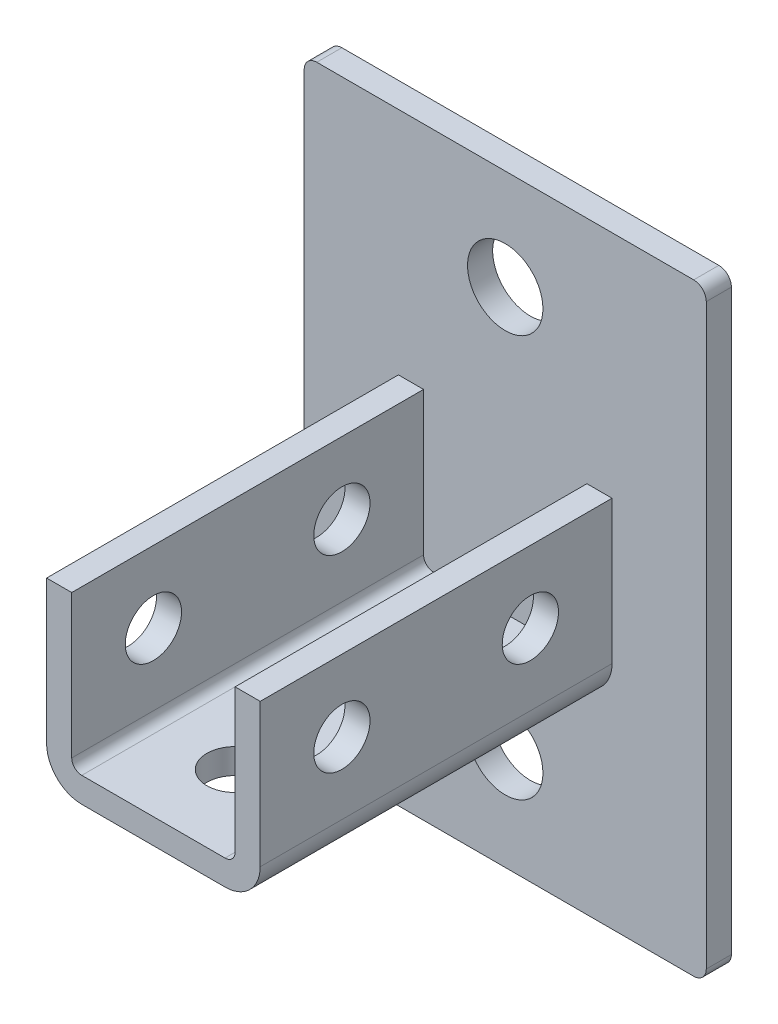
ISO-10303-21;
HEADER;
FILE_DESCRIPTION(('STEP AP214'),'2;1');
FILE_NAME('part.step','',(''),(''),'','','');
FILE_SCHEMA(('AUTOMOTIVE_DESIGN { 1 0 10303 214 1 1 1 1 }'));
ENDSEC;
DATA;
#1=APPLICATION_CONTEXT('core data for automotive mechanical design processes');
#2=APPLICATION_PROTOCOL_DEFINITION('international standard','automotive_design',2000,#1);
#3=PRODUCT_CONTEXT('',#1,'mechanical');
#4=PRODUCT('Part','Part','',(#3));
#5=PRODUCT_RELATED_PRODUCT_CATEGORY('part','',(#4));
#6=PRODUCT_DEFINITION_FORMATION('','',#4);
#7=PRODUCT_DEFINITION_CONTEXT('part definition',#1,'design');
#8=PRODUCT_DEFINITION('design','',#6,#7);
#9=PRODUCT_DEFINITION_SHAPE('','',#8);
#10=(LENGTH_UNIT() NAMED_UNIT(*) SI_UNIT(.MILLI.,.METRE.));
#11=(NAMED_UNIT(*) PLANE_ANGLE_UNIT() SI_UNIT($,.RADIAN.));
#12=(NAMED_UNIT(*) SI_UNIT($,.STERADIAN.) SOLID_ANGLE_UNIT());
#13=UNCERTAINTY_MEASURE_WITH_UNIT(LENGTH_MEASURE(1.E-05),#10,'distance_accuracy_value','');
#14=(GEOMETRIC_REPRESENTATION_CONTEXT(3) GLOBAL_UNCERTAINTY_ASSIGNED_CONTEXT((#13)) GLOBAL_UNIT_ASSIGNED_CONTEXT((#10,
#11,#12)) REPRESENTATION_CONTEXT('',''));
#15=CARTESIAN_POINT('',(0.,0.,0.));
#16=DIRECTION('',(0.,0.,1.));
#17=DIRECTION('',(1.,0.,0.));
#18=AXIS2_PLACEMENT_3D('',#15,#16,#17);
#19=CARTESIAN_POINT('',(-20.6375,18.0975,95.25));
#20=DIRECTION('',(-1.,0.,0.));
#21=DIRECTION('',(0.,-1.,0.));
#22=AXIS2_PLACEMENT_3D('',#19,#20,#21);
#23=PLANE('',#22);
#24=DIRECTION('',(0.,1.,0.));
#25=VECTOR('',#24,1.);
#26=CARTESIAN_POINT('',(-20.6375,18.0975,6.35));
#27=LINE('',#26,#25);
#28=CARTESIAN_POINT('',(-20.6375,-18.0975,6.35));
#29=VERTEX_POINT('',#28);
#30=CARTESIAN_POINT('',(-20.6375,18.0975,6.35));
#31=VERTEX_POINT('',#30);
#32=EDGE_CURVE('E207',#29,#31,#27,.T.);
#33=ORIENTED_EDGE('',*,*,#32,.T.);
#34=DIRECTION('',(0.,0.,-1.));
#35=VECTOR('',#34,1.);
#36=CARTESIAN_POINT('',(-20.6375,18.0975,95.25));
#37=LINE('',#36,#35);
#38=CARTESIAN_POINT('',(-20.6375,18.0975,95.25));
#39=VERTEX_POINT('',#38);
#40=EDGE_CURVE('E308',#39,#31,#37,.T.);
#41=ORIENTED_EDGE('',*,*,#40,.F.);
#42=DIRECTION('',(0.,1.,0.));
#43=VECTOR('',#42,1.);
#44=CARTESIAN_POINT('',(-20.6375,18.0975,95.25));
#45=LINE('',#44,#43);
#46=CARTESIAN_POINT('',(-20.6375,-18.0975,95.25));
#47=VERTEX_POINT('',#46);
#48=EDGE_CURVE('E208',#47,#39,#45,.T.);
#49=ORIENTED_EDGE('',*,*,#48,.F.);
#50=DIRECTION('',(0.,0.,-1.));
#51=VECTOR('',#50,1.);
#52=CARTESIAN_POINT('',(-20.6375,-18.0975,95.25));
#53=LINE('',#52,#51);
#54=EDGE_CURVE('E245',#47,#29,#53,.T.);
#55=ORIENTED_EDGE('',*,*,#54,.T.);
#56=EDGE_LOOP('',(#33,#41,#49,#55));
#57=FACE_BOUND('',#56,.T.);
#58=CARTESIAN_POINT('',(-20.6375,0.,74.6125));
#59=DIRECTION('',(-1.,0.,0.));
#60=DIRECTION('',(0.,-1.,0.));
#61=AXIS2_PLACEMENT_3D('',#58,#59,#60);
#62=CIRCLE('',#61,7.11199999999999);
#63=CARTESIAN_POINT('',(-20.6375,-7.11199999999992,74.6125));
#64=VERTEX_POINT('',#63);
#65=EDGE_CURVE('E179',#64,#64,#62,.F.);
#66=ORIENTED_EDGE('',*,*,#65,.F.);
#67=EDGE_LOOP('',(#66));
#68=FACE_BOUND('',#67,.T.);
#69=CARTESIAN_POINT('',(-20.6375,0.,26.9875));
#70=DIRECTION('',(-1.,0.,0.));
#71=DIRECTION('',(0.,-1.,0.));
#72=AXIS2_PLACEMENT_3D('',#69,#70,#71);
#73=CIRCLE('',#72,7.112);
#74=CARTESIAN_POINT('',(-20.6375,-7.11199999999993,26.9875));
#75=VERTEX_POINT('',#74);
#76=EDGE_CURVE('E183',#75,#75,#73,.F.);
#77=ORIENTED_EDGE('',*,*,#76,.F.);
#78=EDGE_LOOP('',(#77));
#79=FACE_BOUND('',#78,.T.);
#80=ADVANCED_FACE('F32',(#57,#68,#79),#23,.F.);
#81=CARTESIAN_POINT('',(-26.9875,18.0975,95.25));
#82=DIRECTION('',(-1.,0.,0.));
#83=DIRECTION('',(0.,-1.,0.));
#84=AXIS2_PLACEMENT_3D('',#81,#82,#83);
#85=PLANE('',#84);
#86=CARTESIAN_POINT('',(-26.9875,0.,74.6125));
#87=DIRECTION('',(-1.,0.,0.));
#88=DIRECTION('',(0.,-1.,0.));
#89=AXIS2_PLACEMENT_3D('',#86,#87,#88);
#90=CIRCLE('',#89,7.11199999999999);
#91=CARTESIAN_POINT('',(-26.9875,-7.1119999999999,74.6125));
#92=VERTEX_POINT('',#91);
#93=EDGE_CURVE('E187',#92,#92,#90,.F.);
#94=ORIENTED_EDGE('',*,*,#93,.T.);
#95=EDGE_LOOP('',(#94));
#96=FACE_BOUND('',#95,.T.);
#97=DIRECTION('',(0.,1.,0.));
#98=VECTOR('',#97,1.);
#99=CARTESIAN_POINT('',(-26.9875,18.0975,6.35));
#100=LINE('',#99,#98);
#101=CARTESIAN_POINT('',(-26.9875,-18.0975,6.35));
#102=VERTEX_POINT('',#101);
#103=CARTESIAN_POINT('',(-26.9875,18.0975,6.35));
#104=VERTEX_POINT('',#103);
#105=EDGE_CURVE('E251',#102,#104,#100,.T.);
#106=ORIENTED_EDGE('',*,*,#105,.F.);
#107=DIRECTION('',(0.,0.,-1.));
#108=VECTOR('',#107,1.);
#109=CARTESIAN_POINT('',(-26.9875,-18.0975,95.25));
#110=LINE('',#109,#108);
#111=CARTESIAN_POINT('',(-26.9875,-18.0975,95.25));
#112=VERTEX_POINT('',#111);
#113=EDGE_CURVE('E302',#112,#102,#110,.T.);
#114=ORIENTED_EDGE('',*,*,#113,.F.);
#115=DIRECTION('',(0.,1.,0.));
#116=VECTOR('',#115,1.);
#117=CARTESIAN_POINT('',(-26.9875,18.0975,95.25));
#118=LINE('',#117,#116);
#119=CARTESIAN_POINT('',(-26.9875,18.0975,95.25));
#120=VERTEX_POINT('',#119);
#121=EDGE_CURVE('E215',#112,#120,#118,.T.);
#122=ORIENTED_EDGE('',*,*,#121,.T.);
#123=DIRECTION('',(0.,0.,-1.));
#124=VECTOR('',#123,1.);
#125=CARTESIAN_POINT('',(-26.9875,18.0975,95.25));
#126=LINE('',#125,#124);
#127=EDGE_CURVE('E305',#120,#104,#126,.T.);
#128=ORIENTED_EDGE('',*,*,#127,.T.);
#129=EDGE_LOOP('',(#106,#114,#122,#128));
#130=FACE_BOUND('',#129,.T.);
#131=CARTESIAN_POINT('',(-26.9875,0.,26.9875));
#132=DIRECTION('',(-1.,0.,0.));
#133=DIRECTION('',(0.,-1.,0.));
#134=AXIS2_PLACEMENT_3D('',#131,#132,#133);
#135=CIRCLE('',#134,7.112);
#136=CARTESIAN_POINT('',(-26.9875,-7.11199999999991,26.9875));
#137=VERTEX_POINT('',#136);
#138=EDGE_CURVE('E190',#137,#137,#135,.F.);
#139=ORIENTED_EDGE('',*,*,#138,.T.);
#140=EDGE_LOOP('',(#139));
#141=FACE_BOUND('',#140,.T.);
#142=ADVANCED_FACE('F357',(#96,#130,#141),#85,.T.);
#143=CARTESIAN_POINT('',(26.9875,18.0975,95.25));
#144=DIRECTION('',(1.,0.,0.));
#145=DIRECTION('',(0.,1.,0.));
#146=AXIS2_PLACEMENT_3D('',#143,#144,#145);
#147=PLANE('',#146);
#148=CARTESIAN_POINT('',(26.9875,0.,74.6125));
#149=DIRECTION('',(1.,0.,0.));
#150=DIRECTION('',(0.,1.,0.));
#151=AXIS2_PLACEMENT_3D('',#148,#149,#150);
#152=CIRCLE('',#151,7.11199999999999);
#153=CARTESIAN_POINT('',(26.9875,7.1119999999999,74.6125));
#154=VERTEX_POINT('',#153);
#155=EDGE_CURVE('E182',#154,#154,#152,.F.);
#156=ORIENTED_EDGE('',*,*,#155,.T.);
#157=EDGE_LOOP('',(#156));
#158=FACE_BOUND('',#157,.T.);
#159=DIRECTION('',(0.,-1.,0.));
#160=VECTOR('',#159,1.);
#161=CARTESIAN_POINT('',(26.9875,18.0975,6.35));
#162=LINE('',#161,#160);
#163=CARTESIAN_POINT('',(26.9875,18.0975,6.35));
#164=VERTEX_POINT('',#163);
#165=CARTESIAN_POINT('',(26.9875,-18.0975,6.35));
#166=VERTEX_POINT('',#165);
#167=EDGE_CURVE('E263',#164,#166,#162,.T.);
#168=ORIENTED_EDGE('',*,*,#167,.F.);
#169=DIRECTION('',(0.,0.,-1.));
#170=VECTOR('',#169,1.);
#171=CARTESIAN_POINT('',(26.9875,18.0975,95.25));
#172=LINE('',#171,#170);
#173=CARTESIAN_POINT('',(26.9875,18.0975,95.25));
#174=VERTEX_POINT('',#173);
#175=EDGE_CURVE('E290',#174,#164,#172,.T.);
#176=ORIENTED_EDGE('',*,*,#175,.F.);
#177=DIRECTION('',(0.,-1.,0.));
#178=VECTOR('',#177,1.);
#179=CARTESIAN_POINT('',(26.9875,18.0975,95.25));
#180=LINE('',#179,#178);
#181=CARTESIAN_POINT('',(26.9875,-18.0975,95.25));
#182=VERTEX_POINT('',#181);
#183=EDGE_CURVE('E227',#174,#182,#180,.T.);
#184=ORIENTED_EDGE('',*,*,#183,.T.);
#185=DIRECTION('',(0.,0.,-1.));
#186=VECTOR('',#185,1.);
#187=CARTESIAN_POINT('',(26.9875,-18.0975,95.25));
#188=LINE('',#187,#186);
#189=EDGE_CURVE('E293',#182,#166,#188,.T.);
#190=ORIENTED_EDGE('',*,*,#189,.T.);
#191=EDGE_LOOP('',(#168,#176,#184,#190));
#192=FACE_BOUND('',#191,.T.);
#193=CARTESIAN_POINT('',(26.9875,0.,26.9875));
#194=DIRECTION('',(1.,0.,0.));
#195=DIRECTION('',(0.,1.,0.));
#196=AXIS2_PLACEMENT_3D('',#193,#194,#195);
#197=CIRCLE('',#196,7.112);
#198=CARTESIAN_POINT('',(26.9875,7.11199999999991,26.9875));
#199=VERTEX_POINT('',#198);
#200=EDGE_CURVE('E195',#199,#199,#197,.F.);
#201=ORIENTED_EDGE('',*,*,#200,.T.);
#202=EDGE_LOOP('',(#201));
#203=FACE_BOUND('',#202,.T.);
#204=ADVANCED_FACE('F363',(#158,#192,#203),#147,.T.);
#205=CARTESIAN_POINT('',(20.6375,18.0975,95.25));
#206=DIRECTION('',(1.,0.,0.));
#207=DIRECTION('',(0.,1.,0.));
#208=AXIS2_PLACEMENT_3D('',#205,#206,#207);
#209=PLANE('',#208);
#210=DIRECTION('',(0.,-1.,0.));
#211=VECTOR('',#210,1.);
#212=CARTESIAN_POINT('',(20.6375,18.0975,6.35));
#213=LINE('',#212,#211);
#214=CARTESIAN_POINT('',(20.6375,18.0975,6.35));
#215=VERTEX_POINT('',#214);
#216=CARTESIAN_POINT('',(20.6375,-18.0975,6.35));
#217=VERTEX_POINT('',#216);
#218=EDGE_CURVE('E269',#215,#217,#213,.T.);
#219=ORIENTED_EDGE('',*,*,#218,.T.);
#220=DIRECTION('',(0.,0.,-1.));
#221=VECTOR('',#220,1.);
#222=CARTESIAN_POINT('',(20.6375,-18.0975,95.25));
#223=LINE('',#222,#221);
#224=CARTESIAN_POINT('',(20.6375,-18.0975,95.25));
#225=VERTEX_POINT('',#224);
#226=EDGE_CURVE('E284',#225,#217,#223,.T.);
#227=ORIENTED_EDGE('',*,*,#226,.F.);
#228=DIRECTION('',(0.,-1.,0.));
#229=VECTOR('',#228,1.);
#230=CARTESIAN_POINT('',(20.6375,18.0975,95.25));
#231=LINE('',#230,#229);
#232=CARTESIAN_POINT('',(20.6375,18.0975,95.25));
#233=VERTEX_POINT('',#232);
#234=EDGE_CURVE('E233',#233,#225,#231,.T.);
#235=ORIENTED_EDGE('',*,*,#234,.F.);
#236=DIRECTION('',(0.,0.,-1.));
#237=VECTOR('',#236,1.);
#238=CARTESIAN_POINT('',(20.6375,18.0975,95.25));
#239=LINE('',#238,#237);
#240=EDGE_CURVE('E287',#233,#215,#239,.T.);
#241=ORIENTED_EDGE('',*,*,#240,.T.);
#242=EDGE_LOOP('',(#219,#227,#235,#241));
#243=FACE_BOUND('',#242,.T.);
#244=CARTESIAN_POINT('',(20.6375,0.,74.6125));
#245=DIRECTION('',(1.,0.,0.));
#246=DIRECTION('',(0.,1.,0.));
#247=AXIS2_PLACEMENT_3D('',#244,#245,#246);
#248=CIRCLE('',#247,7.11199999999999);
#249=CARTESIAN_POINT('',(20.6375,7.11199999999992,74.6125));
#250=VERTEX_POINT('',#249);
#251=EDGE_CURVE('E180',#250,#250,#248,.F.);
#252=ORIENTED_EDGE('',*,*,#251,.F.);
#253=EDGE_LOOP('',(#252));
#254=FACE_BOUND('',#253,.T.);
#255=CARTESIAN_POINT('',(20.6375,0.,26.9875));
#256=DIRECTION('',(1.,0.,0.));
#257=DIRECTION('',(0.,1.,0.));
#258=AXIS2_PLACEMENT_3D('',#255,#256,#257);
#259=CIRCLE('',#258,7.112);
#260=CARTESIAN_POINT('',(20.6375,7.11199999999993,26.9875));
#261=VERTEX_POINT('',#260);
#262=EDGE_CURVE('E36',#261,#261,#259,.F.);
#263=ORIENTED_EDGE('',*,*,#262,.F.);
#264=EDGE_LOOP('',(#263));
#265=FACE_BOUND('',#264,.T.);
#266=ADVANCED_FACE('F543',(#243,#254,#265),#209,.F.);
#267=CARTESIAN_POINT('',(-18.0975,-26.9875,95.25));
#268=DIRECTION('',(0.,-1.,0.));
#269=DIRECTION('',(0.,0.,-1.));
#270=AXIS2_PLACEMENT_3D('',#267,#268,#269);
#271=PLANE('',#270);
#272=CARTESIAN_POINT('',(0.,-26.9875,74.6125));
#273=DIRECTION('',(0.,-1.,0.));
#274=DIRECTION('',(0.,0.,-1.));
#275=AXIS2_PLACEMENT_3D('',#272,#273,#274);
#276=CIRCLE('',#275,7.11199999999999);
#277=CARTESIAN_POINT('',(0.,-26.9875,67.5005));
#278=VERTEX_POINT('',#277);
#279=EDGE_CURVE('E175',#278,#278,#276,.F.);
#280=ORIENTED_EDGE('',*,*,#279,.T.);
#281=EDGE_LOOP('',(#280));
#282=FACE_BOUND('',#281,.T.);
#283=DIRECTION('',(1.,0.,0.));
#284=VECTOR('',#283,1.);
#285=CARTESIAN_POINT('',(-18.0975,-26.9875,6.35));
#286=LINE('',#285,#284);
#287=CARTESIAN_POINT('',(18.0975,-26.9875,6.35));
#288=VERTEX_POINT('',#287);
#289=CARTESIAN_POINT('',(-18.0975,-26.9875,6.35));
#290=VERTEX_POINT('',#289);
#291=EDGE_CURVE('E257',#288,#290,#286,.F.);
#292=ORIENTED_EDGE('',*,*,#291,.F.);
#293=DIRECTION('',(0.,0.,-1.));
#294=VECTOR('',#293,1.);
#295=CARTESIAN_POINT('',(18.0975,-26.9875,95.25));
#296=LINE('',#295,#294);
#297=CARTESIAN_POINT('',(18.0975,-26.9875,95.25));
#298=VERTEX_POINT('',#297);
#299=EDGE_CURVE('E296',#298,#288,#296,.T.);
#300=ORIENTED_EDGE('',*,*,#299,.F.);
#301=DIRECTION('',(1.,0.,0.));
#302=VECTOR('',#301,1.);
#303=CARTESIAN_POINT('',(-18.0975,-26.9875,95.25));
#304=LINE('',#303,#302);
#305=CARTESIAN_POINT('',(-18.0975,-26.9875,95.25));
#306=VERTEX_POINT('',#305);
#307=EDGE_CURVE('E221',#298,#306,#304,.F.);
#308=ORIENTED_EDGE('',*,*,#307,.T.);
#309=DIRECTION('',(0.,0.,-1.));
#310=VECTOR('',#309,1.);
#311=CARTESIAN_POINT('',(-18.0975,-26.9875,95.25));
#312=LINE('',#311,#310);
#313=EDGE_CURVE('E299',#306,#290,#312,.T.);
#314=ORIENTED_EDGE('',*,*,#313,.T.);
#315=EDGE_LOOP('',(#292,#300,#308,#314));
#316=FACE_BOUND('',#315,.T.);
#317=CARTESIAN_POINT('',(0.,-26.9875,26.9875));
#318=DIRECTION('',(0.,-1.,0.));
#319=DIRECTION('',(0.,0.,-1.));
#320=AXIS2_PLACEMENT_3D('',#317,#318,#319);
#321=CIRCLE('',#320,7.112);
#322=CARTESIAN_POINT('',(0.,-26.9875,19.8755));
#323=VERTEX_POINT('',#322);
#324=EDGE_CURVE('E176',#323,#323,#321,.F.);
#325=ORIENTED_EDGE('',*,*,#324,.T.);
#326=EDGE_LOOP('',(#325));
#327=FACE_BOUND('',#326,.T.);
#328=ADVANCED_FACE('F550',(#282,#316,#327),#271,.T.);
#329=CARTESIAN_POINT('',(-18.0975,-20.6375,95.25));
#330=DIRECTION('',(0.,-1.,0.));
#331=DIRECTION('',(0.,0.,-1.));
#332=AXIS2_PLACEMENT_3D('',#329,#330,#331);
#333=PLANE('',#332);
#334=DIRECTION('',(-1.,0.,0.));
#335=VECTOR('',#334,1.);
#336=CARTESIAN_POINT('',(-18.0975,-20.6375,6.35));
#337=LINE('',#336,#335);
#338=CARTESIAN_POINT('',(18.0975,-20.6375,6.35));
#339=VERTEX_POINT('',#338);
#340=CARTESIAN_POINT('',(-18.0975,-20.6375,6.34999999999999));
#341=VERTEX_POINT('',#340);
#342=EDGE_CURVE('E275',#339,#341,#337,.T.);
#343=ORIENTED_EDGE('',*,*,#342,.T.);
#344=DIRECTION('',(0.,0.,-1.));
#345=VECTOR('',#344,1.);
#346=CARTESIAN_POINT('',(-18.0975,-20.6375,95.25));
#347=LINE('',#346,#345);
#348=CARTESIAN_POINT('',(-18.0975,-20.6375,95.25));
#349=VERTEX_POINT('',#348);
#350=EDGE_CURVE('E49',#349,#341,#347,.T.);
#351=ORIENTED_EDGE('',*,*,#350,.F.);
#352=DIRECTION('',(-1.,0.,0.));
#353=VECTOR('',#352,1.);
#354=CARTESIAN_POINT('',(-18.0975,-20.6375,95.25));
#355=LINE('',#354,#353);
#356=CARTESIAN_POINT('',(18.0975,-20.6375,95.25));
#357=VERTEX_POINT('',#356);
#358=EDGE_CURVE('E239',#357,#349,#355,.T.);
#359=ORIENTED_EDGE('',*,*,#358,.F.);
#360=DIRECTION('',(0.,0.,-1.));
#361=VECTOR('',#360,1.);
#362=CARTESIAN_POINT('',(18.0975,-20.6375,95.25));
#363=LINE('',#362,#361);
#364=EDGE_CURVE('E281',#357,#339,#363,.T.);
#365=ORIENTED_EDGE('',*,*,#364,.T.);
#366=EDGE_LOOP('',(#343,#351,#359,#365));
#367=FACE_BOUND('',#366,.T.);
#368=CARTESIAN_POINT('',(0.,-20.6375,74.6125));
#369=DIRECTION('',(0.,-1.,0.));
#370=DIRECTION('',(0.,0.,-1.));
#371=AXIS2_PLACEMENT_3D('',#368,#369,#370);
#372=CIRCLE('',#371,7.11199999999999);
#373=CARTESIAN_POINT('',(0.,-20.6375,67.5005));
#374=VERTEX_POINT('',#373);
#375=EDGE_CURVE('E172',#374,#374,#372,.F.);
#376=ORIENTED_EDGE('',*,*,#375,.F.);
#377=EDGE_LOOP('',(#376));
#378=FACE_BOUND('',#377,.T.);
#379=CARTESIAN_POINT('',(0.,-20.6375,26.9875));
#380=DIRECTION('',(0.,-1.,0.));
#381=DIRECTION('',(0.,0.,-1.));
#382=AXIS2_PLACEMENT_3D('',#379,#380,#381);
#383=CIRCLE('',#382,7.112);
#384=CARTESIAN_POINT('',(0.,-20.6375,19.8755));
#385=VERTEX_POINT('',#384);
#386=EDGE_CURVE('E177',#385,#385,#383,.F.);
#387=ORIENTED_EDGE('',*,*,#386,.F.);
#388=EDGE_LOOP('',(#387));
#389=FACE_BOUND('',#388,.T.);
#390=ADVANCED_FACE('F380',(#367,#378,#389),#333,.F.);
#391=CARTESIAN_POINT('',(47.625,73.025,6.35));
#392=DIRECTION('',(0.,0.,1.));
#393=DIRECTION('',(1.,0.,0.));
#394=AXIS2_PLACEMENT_3D('',#391,#392,#393);
#395=PLANE('',#394);
#396=CARTESIAN_POINT('',(0.,50.8,6.35));
#397=DIRECTION('',(0.,0.,1.));
#398=DIRECTION('',(1.,0.,0.));
#399=AXIS2_PLACEMENT_3D('',#396,#397,#398);
#400=CIRCLE('',#399,9.525);
#401=CARTESIAN_POINT('',(9.525,50.8,6.35));
#402=VERTEX_POINT('',#401);
#403=EDGE_CURVE('E148',#402,#402,#400,.T.);
#404=ORIENTED_EDGE('',*,*,#403,.F.);
#405=EDGE_LOOP('',(#404));
#406=FACE_BOUND('',#405,.T.);
#407=CARTESIAN_POINT('',(47.625,73.025,6.35));
#408=DIRECTION('',(0.,0.,1.));
#409=DIRECTION('',(1.,0.,0.));
#410=AXIS2_PLACEMENT_3D('',#407,#408,#409);
#411=CIRCLE('',#410,3.175);
#412=CARTESIAN_POINT('',(50.8,73.025,6.35));
#413=VERTEX_POINT('',#412);
#414=CARTESIAN_POINT('',(47.625,76.2,6.35));
#415=VERTEX_POINT('',#414);
#416=EDGE_CURVE('E160',#413,#415,#411,.T.);
#417=ORIENTED_EDGE('',*,*,#416,.T.);
#418=DIRECTION('',(-1.,0.,0.));
#419=VECTOR('',#418,1.);
#420=CARTESIAN_POINT('',(-47.625,76.2,6.35));
#421=LINE('',#420,#419);
#422=CARTESIAN_POINT('',(-47.625,76.2,6.35));
#423=VERTEX_POINT('',#422);
#424=EDGE_CURVE('E99',#415,#423,#421,.T.);
#425=ORIENTED_EDGE('',*,*,#424,.T.);
#426=CARTESIAN_POINT('',(-47.625,73.025,6.35));
#427=DIRECTION('',(0.,0.,1.));
#428=DIRECTION('',(1.,0.,0.));
#429=AXIS2_PLACEMENT_3D('',#426,#427,#428);
#430=CIRCLE('',#429,3.175);
#431=CARTESIAN_POINT('',(-50.8,73.025,6.35));
#432=VERTEX_POINT('',#431);
#433=EDGE_CURVE('E324',#423,#432,#430,.T.);
#434=ORIENTED_EDGE('',*,*,#433,.T.);
#435=DIRECTION('',(0.,-1.,0.));
#436=VECTOR('',#435,1.);
#437=CARTESIAN_POINT('',(-50.8,73.025,6.35));
#438=LINE('',#437,#436);
#439=CARTESIAN_POINT('',(-50.8,-73.025,6.35));
#440=VERTEX_POINT('',#439);
#441=EDGE_CURVE('E326',#432,#440,#438,.T.);
#442=ORIENTED_EDGE('',*,*,#441,.T.);
#443=CARTESIAN_POINT('',(-47.625,-73.025,6.35));
#444=DIRECTION('',(0.,0.,1.));
#445=DIRECTION('',(1.,0.,0.));
#446=AXIS2_PLACEMENT_3D('',#443,#444,#445);
#447=CIRCLE('',#446,3.175);
#448=CARTESIAN_POINT('',(-47.625,-76.2,6.35));
#449=VERTEX_POINT('',#448);
#450=EDGE_CURVE('E123',#440,#449,#447,.T.);
#451=ORIENTED_EDGE('',*,*,#450,.T.);
#452=DIRECTION('',(1.,0.,0.));
#453=VECTOR('',#452,1.);
#454=CARTESIAN_POINT('',(-47.625,-76.2,6.35));
#455=LINE('',#454,#453);
#456=CARTESIAN_POINT('',(47.625,-76.2,6.35));
#457=VERTEX_POINT('',#456);
#458=EDGE_CURVE('E115',#449,#457,#455,.T.);
#459=ORIENTED_EDGE('',*,*,#458,.T.);
#460=CARTESIAN_POINT('',(47.625,-73.025,6.35));
#461=DIRECTION('',(0.,0.,1.));
#462=DIRECTION('',(1.,0.,0.));
#463=AXIS2_PLACEMENT_3D('',#460,#461,#462);
#464=CIRCLE('',#463,3.175);
#465=CARTESIAN_POINT('',(50.8,-73.025,6.35));
#466=VERTEX_POINT('',#465);
#467=EDGE_CURVE('E120',#457,#466,#464,.T.);
#468=ORIENTED_EDGE('',*,*,#467,.T.);
#469=DIRECTION('',(0.,1.,0.));
#470=VECTOR('',#469,1.);
#471=CARTESIAN_POINT('',(50.8,73.025,6.35));
#472=LINE('',#471,#470);
#473=EDGE_CURVE('E58',#466,#413,#472,.T.);
#474=ORIENTED_EDGE('',*,*,#473,.T.);
#475=EDGE_LOOP('',(#417,#425,#434,#442,#451,#459,#468,#474));
#476=FACE_BOUND('',#475,.T.);
#477=CARTESIAN_POINT('',(0.,-50.8,6.35));
#478=DIRECTION('',(0.,0.,1.));
#479=DIRECTION('',(1.,0.,0.));
#480=AXIS2_PLACEMENT_3D('',#477,#478,#479);
#481=CIRCLE('',#480,9.525);
#482=CARTESIAN_POINT('',(9.525,-50.8,6.35));
#483=VERTEX_POINT('',#482);
#484=EDGE_CURVE('E312',#483,#483,#481,.T.);
#485=ORIENTED_EDGE('',*,*,#484,.F.);
#486=EDGE_LOOP('',(#485));
#487=FACE_BOUND('',#486,.T.);
#488=DIRECTION('',(1.,0.,0.));
#489=VECTOR('',#488,1.);
#490=CARTESIAN_POINT('',(-26.9875,18.0975,6.35));
#491=LINE('',#490,#489);
#492=EDGE_CURVE('E248',#104,#31,#491,.T.);
#493=ORIENTED_EDGE('',*,*,#492,.T.);
#494=ORIENTED_EDGE('',*,*,#32,.F.);
#495=CARTESIAN_POINT('',(-18.0975,-18.0975,6.35));
#496=DIRECTION('',(0.,0.,-1.));
#497=DIRECTION('',(1.,0.,0.));
#498=AXIS2_PLACEMENT_3D('',#495,#496,#497);
#499=CIRCLE('',#498,2.54);
#500=EDGE_CURVE('E212',#341,#29,#499,.T.);
#501=ORIENTED_EDGE('',*,*,#500,.F.);
#502=ORIENTED_EDGE('',*,*,#342,.F.);
#503=CARTESIAN_POINT('',(18.0975,-18.0975,6.35));
#504=DIRECTION('',(0.,0.,-1.));
#505=DIRECTION('',(1.,0.,0.));
#506=AXIS2_PLACEMENT_3D('',#503,#504,#505);
#507=CIRCLE('',#506,2.54);
#508=EDGE_CURVE('E272',#217,#339,#507,.T.);
#509=ORIENTED_EDGE('',*,*,#508,.F.);
#510=ORIENTED_EDGE('',*,*,#218,.F.);
#511=DIRECTION('',(1.,0.,0.));
#512=VECTOR('',#511,1.);
#513=CARTESIAN_POINT('',(20.6375,18.0975,6.35));
#514=LINE('',#513,#512);
#515=EDGE_CURVE('E266',#215,#164,#514,.T.);
#516=ORIENTED_EDGE('',*,*,#515,.T.);
#517=ORIENTED_EDGE('',*,*,#167,.T.);
#518=CARTESIAN_POINT('',(18.0975,-18.0975,6.35));
#519=DIRECTION('',(0.,0.,1.));
#520=DIRECTION('',(1.,0.,0.));
#521=AXIS2_PLACEMENT_3D('',#518,#519,#520);
#522=CIRCLE('',#521,8.89);
#523=EDGE_CURVE('E260',#166,#288,#522,.F.);
#524=ORIENTED_EDGE('',*,*,#523,.T.);
#525=ORIENTED_EDGE('',*,*,#291,.T.);
#526=CARTESIAN_POINT('',(-18.0975,-18.0975,6.35));
#527=DIRECTION('',(0.,0.,1.));
#528=DIRECTION('',(1.,0.,0.));
#529=AXIS2_PLACEMENT_3D('',#526,#527,#528);
#530=CIRCLE('',#529,8.89);
#531=EDGE_CURVE('E254',#290,#102,#530,.F.);
#532=ORIENTED_EDGE('',*,*,#531,.T.);
#533=ORIENTED_EDGE('',*,*,#105,.T.);
#534=EDGE_LOOP('',(#493,#494,#501,#502,#509,#510,#516,#517,#524,#525,#532,#533));
#535=FACE_BOUND('',#534,.T.);
#536=ADVANCED_FACE('F117',(#406,#476,#487,#535),#395,.T.);
#537=CARTESIAN_POINT('',(47.625,73.025,0.));
#538=DIRECTION('',(0.,0.,1.));
#539=DIRECTION('',(1.,0.,0.));
#540=AXIS2_PLACEMENT_3D('',#537,#538,#539);
#541=PLANE('',#540);
#542=CARTESIAN_POINT('',(47.625,73.025,0.));
#543=DIRECTION('',(0.,0.,1.));
#544=DIRECTION('',(1.,0.,0.));
#545=AXIS2_PLACEMENT_3D('',#542,#543,#544);
#546=CIRCLE('',#545,3.175);
#547=CARTESIAN_POINT('',(50.8,73.025,0.));
#548=VERTEX_POINT('',#547);
#549=CARTESIAN_POINT('',(47.625,76.2,0.));
#550=VERTEX_POINT('',#549);
#551=EDGE_CURVE('E144',#548,#550,#546,.T.);
#552=ORIENTED_EDGE('',*,*,#551,.F.);
#553=DIRECTION('',(0.,1.,0.));
#554=VECTOR('',#553,1.);
#555=CARTESIAN_POINT('',(50.8,73.025,0.));
#556=LINE('',#555,#554);
#557=CARTESIAN_POINT('',(50.8,-73.025,0.));
#558=VERTEX_POINT('',#557);
#559=EDGE_CURVE('E91',#558,#548,#556,.T.);
#560=ORIENTED_EDGE('',*,*,#559,.F.);
#561=CARTESIAN_POINT('',(47.625,-73.025,0.));
#562=DIRECTION('',(0.,0.,1.));
#563=DIRECTION('',(1.,0.,0.));
#564=AXIS2_PLACEMENT_3D('',#561,#562,#563);
#565=CIRCLE('',#564,3.175);
#566=CARTESIAN_POINT('',(47.625,-76.2,0.));
#567=VERTEX_POINT('',#566);
#568=EDGE_CURVE('E157',#567,#558,#565,.T.);
#569=ORIENTED_EDGE('',*,*,#568,.F.);
#570=DIRECTION('',(1.,0.,0.));
#571=VECTOR('',#570,1.);
#572=CARTESIAN_POINT('',(-47.625,-76.2,0.));
#573=LINE('',#572,#571);
#574=CARTESIAN_POINT('',(-47.625,-76.2,0.));
#575=VERTEX_POINT('',#574);
#576=EDGE_CURVE('E132',#575,#567,#573,.T.);
#577=ORIENTED_EDGE('',*,*,#576,.F.);
#578=CARTESIAN_POINT('',(-47.625,-73.025,0.));
#579=DIRECTION('',(0.,0.,1.));
#580=DIRECTION('',(1.,0.,0.));
#581=AXIS2_PLACEMENT_3D('',#578,#579,#580);
#582=CIRCLE('',#581,3.175);
#583=CARTESIAN_POINT('',(-50.8,-73.025,0.));
#584=VERTEX_POINT('',#583);
#585=EDGE_CURVE('E154',#584,#575,#582,.T.);
#586=ORIENTED_EDGE('',*,*,#585,.F.);
#587=DIRECTION('',(0.,-1.,0.));
#588=VECTOR('',#587,1.);
#589=CARTESIAN_POINT('',(-50.8,73.025,0.));
#590=LINE('',#589,#588);
#591=CARTESIAN_POINT('',(-50.8,73.025,0.));
#592=VERTEX_POINT('',#591);
#593=EDGE_CURVE('E152',#592,#584,#590,.T.);
#594=ORIENTED_EDGE('',*,*,#593,.F.);
#595=CARTESIAN_POINT('',(-47.625,73.025,0.));
#596=DIRECTION('',(0.,0.,1.));
#597=DIRECTION('',(1.,0.,0.));
#598=AXIS2_PLACEMENT_3D('',#595,#596,#597);
#599=CIRCLE('',#598,3.175);
#600=CARTESIAN_POINT('',(-47.625,76.2,0.));
#601=VERTEX_POINT('',#600);
#602=EDGE_CURVE('E150',#601,#592,#599,.T.);
#603=ORIENTED_EDGE('',*,*,#602,.F.);
#604=DIRECTION('',(-1.,0.,0.));
#605=VECTOR('',#604,1.);
#606=CARTESIAN_POINT('',(-47.625,76.2,0.));
#607=LINE('',#606,#605);
#608=EDGE_CURVE('E147',#550,#601,#607,.T.);
#609=ORIENTED_EDGE('',*,*,#608,.F.);
#610=EDGE_LOOP('',(#552,#560,#569,#577,#586,#594,#603,#609));
#611=FACE_BOUND('',#610,.T.);
#612=CARTESIAN_POINT('',(0.,50.8,0.));
#613=DIRECTION('',(0.,0.,1.));
#614=DIRECTION('',(1.,0.,0.));
#615=AXIS2_PLACEMENT_3D('',#612,#613,#614);
#616=CIRCLE('',#615,9.525);
#617=CARTESIAN_POINT('',(9.525,50.8,0.));
#618=VERTEX_POINT('',#617);
#619=EDGE_CURVE('E315',#618,#618,#616,.T.);
#620=ORIENTED_EDGE('',*,*,#619,.T.);
#621=EDGE_LOOP('',(#620));
#622=FACE_BOUND('',#621,.T.);
#623=CARTESIAN_POINT('',(0.,-50.8,0.));
#624=DIRECTION('',(0.,0.,1.));
#625=DIRECTION('',(1.,0.,0.));
#626=AXIS2_PLACEMENT_3D('',#623,#624,#625);
#627=CIRCLE('',#626,9.525);
#628=CARTESIAN_POINT('',(9.525,-50.8,0.));
#629=VERTEX_POINT('',#628);
#630=EDGE_CURVE('E311',#629,#629,#627,.T.);
#631=ORIENTED_EDGE('',*,*,#630,.T.);
#632=EDGE_LOOP('',(#631));
#633=FACE_BOUND('',#632,.T.);
#634=ADVANCED_FACE('F339',(#611,#622,#633),#541,.F.);
#635=CARTESIAN_POINT('',(47.625,73.025,6.35));
#636=DIRECTION('',(0.,0.,-1.));
#637=DIRECTION('',(-1.,0.,0.));
#638=AXIS2_PLACEMENT_3D('',#635,#636,#637);
#639=CYLINDRICAL_SURFACE('',#638,3.175);
#640=ORIENTED_EDGE('',*,*,#551,.T.);
#641=DIRECTION('',(0.,0.,-1.));
#642=VECTOR('',#641,1.);
#643=CARTESIAN_POINT('',(47.625,76.2,6.35));
#644=LINE('',#643,#642);
#645=EDGE_CURVE('E11',#415,#550,#644,.T.);
#646=ORIENTED_EDGE('',*,*,#645,.F.);
#647=ORIENTED_EDGE('',*,*,#416,.F.);
#648=DIRECTION('',(0.,0.,-1.));
#649=VECTOR('',#648,1.);
#650=CARTESIAN_POINT('',(50.8,73.025,6.35));
#651=LINE('',#650,#649);
#652=EDGE_CURVE('E140',#413,#548,#651,.T.);
#653=ORIENTED_EDGE('',*,*,#652,.T.);
#654=EDGE_LOOP('',(#640,#646,#647,#653));
#655=FACE_BOUND('',#654,.T.);
#656=ADVANCED_FACE('F34',(#655),#639,.T.);
#657=CARTESIAN_POINT('',(-47.625,76.2,6.35));
#658=DIRECTION('',(0.,-1.,0.));
#659=DIRECTION('',(0.,0.,-1.));
#660=AXIS2_PLACEMENT_3D('',#657,#658,#659);
#661=PLANE('',#660);
#662=ORIENTED_EDGE('',*,*,#608,.T.);
#663=DIRECTION('',(0.,0.,-1.));
#664=VECTOR('',#663,1.);
#665=CARTESIAN_POINT('',(-47.625,76.2,6.35));
#666=LINE('',#665,#664);
#667=EDGE_CURVE('E41',#423,#601,#666,.T.);
#668=ORIENTED_EDGE('',*,*,#667,.F.);
#669=ORIENTED_EDGE('',*,*,#424,.F.);
#670=ORIENTED_EDGE('',*,*,#645,.T.);
#671=EDGE_LOOP('',(#662,#668,#669,#670));
#672=FACE_BOUND('',#671,.T.);
#673=ADVANCED_FACE('F345',(#672),#661,.F.);
#674=CARTESIAN_POINT('',(-47.625,73.025,6.35));
#675=DIRECTION('',(0.,0.,-1.));
#676=DIRECTION('',(-1.,0.,0.));
#677=AXIS2_PLACEMENT_3D('',#674,#675,#676);
#678=CYLINDRICAL_SURFACE('',#677,3.175);
#679=ORIENTED_EDGE('',*,*,#602,.T.);
#680=DIRECTION('',(0.,0.,-1.));
#681=VECTOR('',#680,1.);
#682=CARTESIAN_POINT('',(-50.8,73.025,6.35));
#683=LINE('',#682,#681);
#684=EDGE_CURVE('E167',#432,#592,#683,.T.);
#685=ORIENTED_EDGE('',*,*,#684,.F.);
#686=ORIENTED_EDGE('',*,*,#433,.F.);
#687=ORIENTED_EDGE('',*,*,#667,.T.);
#688=EDGE_LOOP('',(#679,#685,#686,#687));
#689=FACE_BOUND('',#688,.T.);
#690=ADVANCED_FACE('F348',(#689),#678,.T.);
#691=CARTESIAN_POINT('',(-50.8,73.025,6.35));
#692=DIRECTION('',(1.,0.,0.));
#693=DIRECTION('',(0.,1.,0.));
#694=AXIS2_PLACEMENT_3D('',#691,#692,#693);
#695=PLANE('',#694);
#696=ORIENTED_EDGE('',*,*,#593,.T.);
#697=DIRECTION('',(0.,0.,-1.));
#698=VECTOR('',#697,1.);
#699=CARTESIAN_POINT('',(-50.8,-73.025,6.35));
#700=LINE('',#699,#698);
#701=EDGE_CURVE('E164',#440,#584,#700,.T.);
#702=ORIENTED_EDGE('',*,*,#701,.F.);
#703=ORIENTED_EDGE('',*,*,#441,.F.);
#704=ORIENTED_EDGE('',*,*,#684,.T.);
#705=EDGE_LOOP('',(#696,#702,#703,#704));
#706=FACE_BOUND('',#705,.T.);
#707=ADVANCED_FACE('F332',(#706),#695,.F.);
#708=CARTESIAN_POINT('',(-47.625,-73.025,6.35));
#709=DIRECTION('',(0.,0.,-1.));
#710=DIRECTION('',(-1.,0.,0.));
#711=AXIS2_PLACEMENT_3D('',#708,#709,#710);
#712=CYLINDRICAL_SURFACE('',#711,3.175);
#713=ORIENTED_EDGE('',*,*,#585,.T.);
#714=DIRECTION('',(0.,0.,-1.));
#715=VECTOR('',#714,1.);
#716=CARTESIAN_POINT('',(-47.625,-76.2,6.35));
#717=LINE('',#716,#715);
#718=EDGE_CURVE('E135',#449,#575,#717,.T.);
#719=ORIENTED_EDGE('',*,*,#718,.F.);
#720=ORIENTED_EDGE('',*,*,#450,.F.);
#721=ORIENTED_EDGE('',*,*,#701,.T.);
#722=EDGE_LOOP('',(#713,#719,#720,#721));
#723=FACE_BOUND('',#722,.T.);
#724=ADVANCED_FACE('F336',(#723),#712,.T.);
#725=CARTESIAN_POINT('',(-47.625,-76.2,6.35));
#726=DIRECTION('',(0.,1.,0.));
#727=DIRECTION('',(0.,0.,1.));
#728=AXIS2_PLACEMENT_3D('',#725,#726,#727);
#729=PLANE('',#728);
#730=ORIENTED_EDGE('',*,*,#576,.T.);
#731=DIRECTION('',(0.,0.,-1.));
#732=VECTOR('',#731,1.);
#733=CARTESIAN_POINT('',(47.625,-76.2,6.35));
#734=LINE('',#733,#732);
#735=EDGE_CURVE('E129',#457,#567,#734,.T.);
#736=ORIENTED_EDGE('',*,*,#735,.F.);
#737=ORIENTED_EDGE('',*,*,#458,.F.);
#738=ORIENTED_EDGE('',*,*,#718,.T.);
#739=EDGE_LOOP('',(#730,#736,#737,#738));
#740=FACE_BOUND('',#739,.T.);
#741=ADVANCED_FACE('F130',(#740),#729,.F.);
#742=CARTESIAN_POINT('',(47.625,-73.025,6.35));
#743=DIRECTION('',(0.,0.,-1.));
#744=DIRECTION('',(-1.,0.,0.));
#745=AXIS2_PLACEMENT_3D('',#742,#743,#744);
#746=CYLINDRICAL_SURFACE('',#745,3.175);
#747=ORIENTED_EDGE('',*,*,#568,.T.);
#748=DIRECTION('',(0.,0.,-1.));
#749=VECTOR('',#748,1.);
#750=CARTESIAN_POINT('',(50.8,-73.025,6.35));
#751=LINE('',#750,#749);
#752=EDGE_CURVE('E136',#466,#558,#751,.T.);
#753=ORIENTED_EDGE('',*,*,#752,.F.);
#754=ORIENTED_EDGE('',*,*,#467,.F.);
#755=ORIENTED_EDGE('',*,*,#735,.T.);
#756=EDGE_LOOP('',(#747,#753,#754,#755));
#757=FACE_BOUND('',#756,.T.);
#758=ADVANCED_FACE('F138',(#757),#746,.T.);
#759=CARTESIAN_POINT('',(50.8,73.025,6.35));
#760=DIRECTION('',(-1.,0.,0.));
#761=DIRECTION('',(0.,-1.,0.));
#762=AXIS2_PLACEMENT_3D('',#759,#760,#761);
#763=PLANE('',#762);
#764=ORIENTED_EDGE('',*,*,#559,.T.);
#765=ORIENTED_EDGE('',*,*,#652,.F.);
#766=ORIENTED_EDGE('',*,*,#473,.F.);
#767=ORIENTED_EDGE('',*,*,#752,.T.);
#768=EDGE_LOOP('',(#764,#765,#766,#767));
#769=FACE_BOUND('',#768,.T.);
#770=ADVANCED_FACE('F341',(#769),#763,.F.);
#771=CARTESIAN_POINT('',(0.,50.8,6.35));
#772=DIRECTION('',(0.,0.,-1.));
#773=DIRECTION('',(-1.,0.,0.));
#774=AXIS2_PLACEMENT_3D('',#771,#772,#773);
#775=CYLINDRICAL_SURFACE('',#774,9.525);
#776=ORIENTED_EDGE('',*,*,#403,.T.);
#777=EDGE_LOOP('',(#776));
#778=FACE_BOUND('',#777,.T.);
#779=ORIENTED_EDGE('',*,*,#619,.F.);
#780=EDGE_LOOP('',(#779));
#781=FACE_BOUND('',#780,.T.);
#782=ADVANCED_FACE('F373',(#778,#781),#775,.F.);
#783=CARTESIAN_POINT('',(0.,-50.8,6.35));
#784=DIRECTION('',(0.,0.,-1.));
#785=DIRECTION('',(-1.,0.,0.));
#786=AXIS2_PLACEMENT_3D('',#783,#784,#785);
#787=CYLINDRICAL_SURFACE('',#786,9.525);
#788=ORIENTED_EDGE('',*,*,#484,.T.);
#789=EDGE_LOOP('',(#788));
#790=FACE_BOUND('',#789,.T.);
#791=ORIENTED_EDGE('',*,*,#630,.F.);
#792=EDGE_LOOP('',(#791));
#793=FACE_BOUND('',#792,.T.);
#794=ADVANCED_FACE('F370',(#790,#793),#787,.F.);
#795=CARTESIAN_POINT('',(-26.9875,18.0975,95.25));
#796=DIRECTION('',(0.,1.,0.));
#797=DIRECTION('',(0.,0.,1.));
#798=AXIS2_PLACEMENT_3D('',#795,#796,#797);
#799=PLANE('',#798);
#800=ORIENTED_EDGE('',*,*,#492,.F.);
#801=ORIENTED_EDGE('',*,*,#127,.F.);
#802=DIRECTION('',(1.,0.,0.));
#803=VECTOR('',#802,1.);
#804=CARTESIAN_POINT('',(-26.9875,18.0975,95.25));
#805=LINE('',#804,#803);
#806=EDGE_CURVE('E211',#120,#39,#805,.T.);
#807=ORIENTED_EDGE('',*,*,#806,.T.);
#808=ORIENTED_EDGE('',*,*,#40,.T.);
#809=EDGE_LOOP('',(#800,#801,#807,#808));
#810=FACE_BOUND('',#809,.T.);
#811=ADVANCED_FACE('F369',(#810),#799,.T.);
#812=CARTESIAN_POINT('',(-18.0975,-18.0975,95.25));
#813=DIRECTION('',(0.,0.,-1.));
#814=DIRECTION('',(-1.,0.,0.));
#815=AXIS2_PLACEMENT_3D('',#812,#813,#814);
#816=CYLINDRICAL_SURFACE('',#815,8.89);
#817=ORIENTED_EDGE('',*,*,#531,.F.);
#818=ORIENTED_EDGE('',*,*,#313,.F.);
#819=CARTESIAN_POINT('',(-18.0975,-18.0975,95.25));
#820=DIRECTION('',(0.,0.,1.));
#821=DIRECTION('',(1.,0.,0.));
#822=AXIS2_PLACEMENT_3D('',#819,#820,#821);
#823=CIRCLE('',#822,8.89);
#824=EDGE_CURVE('E218',#306,#112,#823,.F.);
#825=ORIENTED_EDGE('',*,*,#824,.T.);
#826=ORIENTED_EDGE('',*,*,#113,.T.);
#827=EDGE_LOOP('',(#817,#818,#825,#826));
#828=FACE_BOUND('',#827,.T.);
#829=ADVANCED_FACE('F422',(#828),#816,.T.);
#830=CARTESIAN_POINT('',(18.0975,-18.0975,95.25));
#831=DIRECTION('',(0.,0.,-1.));
#832=DIRECTION('',(-1.,0.,0.));
#833=AXIS2_PLACEMENT_3D('',#830,#831,#832);
#834=CYLINDRICAL_SURFACE('',#833,8.89);
#835=ORIENTED_EDGE('',*,*,#523,.F.);
#836=ORIENTED_EDGE('',*,*,#189,.F.);
#837=CARTESIAN_POINT('',(18.0975,-18.0975,95.25));
#838=DIRECTION('',(0.,0.,1.));
#839=DIRECTION('',(1.,0.,0.));
#840=AXIS2_PLACEMENT_3D('',#837,#838,#839);
#841=CIRCLE('',#840,8.89);
#842=EDGE_CURVE('E224',#182,#298,#841,.F.);
#843=ORIENTED_EDGE('',*,*,#842,.T.);
#844=ORIENTED_EDGE('',*,*,#299,.T.);
#845=EDGE_LOOP('',(#835,#836,#843,#844));
#846=FACE_BOUND('',#845,.T.);
#847=ADVANCED_FACE('F429',(#846),#834,.T.);
#848=CARTESIAN_POINT('',(20.6375,18.0975,95.25));
#849=DIRECTION('',(0.,1.,0.));
#850=DIRECTION('',(0.,0.,1.));
#851=AXIS2_PLACEMENT_3D('',#848,#849,#850);
#852=PLANE('',#851);
#853=ORIENTED_EDGE('',*,*,#515,.F.);
#854=ORIENTED_EDGE('',*,*,#240,.F.);
#855=DIRECTION('',(1.,0.,0.));
#856=VECTOR('',#855,1.);
#857=CARTESIAN_POINT('',(20.6375,18.0975,95.25));
#858=LINE('',#857,#856);
#859=EDGE_CURVE('E230',#233,#174,#858,.T.);
#860=ORIENTED_EDGE('',*,*,#859,.T.);
#861=ORIENTED_EDGE('',*,*,#175,.T.);
#862=EDGE_LOOP('',(#853,#854,#860,#861));
#863=FACE_BOUND('',#862,.T.);
#864=ADVANCED_FACE('F437',(#863),#852,.T.);
#865=CARTESIAN_POINT('',(18.0975,-18.0975,95.25));
#866=DIRECTION('',(0.,0.,-1.));
#867=DIRECTION('',(-1.,0.,0.));
#868=AXIS2_PLACEMENT_3D('',#865,#866,#867);
#869=CYLINDRICAL_SURFACE('',#868,2.54);
#870=ORIENTED_EDGE('',*,*,#508,.T.);
#871=ORIENTED_EDGE('',*,*,#364,.F.);
#872=CARTESIAN_POINT('',(18.0975,-18.0975,95.25));
#873=DIRECTION('',(0.,0.,-1.));
#874=DIRECTION('',(1.,0.,0.));
#875=AXIS2_PLACEMENT_3D('',#872,#873,#874);
#876=CIRCLE('',#875,2.54);
#877=EDGE_CURVE('E236',#225,#357,#876,.T.);
#878=ORIENTED_EDGE('',*,*,#877,.F.);
#879=ORIENTED_EDGE('',*,*,#226,.T.);
#880=EDGE_LOOP('',(#870,#871,#878,#879));
#881=FACE_BOUND('',#880,.T.);
#882=ADVANCED_FACE('F445',(#881),#869,.F.);
#883=CARTESIAN_POINT('',(-18.0975,-18.0975,95.25));
#884=DIRECTION('',(0.,0.,-1.));
#885=DIRECTION('',(-1.,0.,0.));
#886=AXIS2_PLACEMENT_3D('',#883,#884,#885);
#887=CYLINDRICAL_SURFACE('',#886,2.54);
#888=ORIENTED_EDGE('',*,*,#500,.T.);
#889=ORIENTED_EDGE('',*,*,#54,.F.);
#890=CARTESIAN_POINT('',(-18.0975,-18.0975,95.25));
#891=DIRECTION('',(0.,0.,-1.));
#892=DIRECTION('',(1.,0.,0.));
#893=AXIS2_PLACEMENT_3D('',#890,#891,#892);
#894=CIRCLE('',#893,2.54);
#895=EDGE_CURVE('E242',#349,#47,#894,.T.);
#896=ORIENTED_EDGE('',*,*,#895,.F.);
#897=ORIENTED_EDGE('',*,*,#350,.T.);
#898=EDGE_LOOP('',(#888,#889,#896,#897));
#899=FACE_BOUND('',#898,.T.);
#900=ADVANCED_FACE('F453',(#899),#887,.F.);
#901=CARTESIAN_POINT('',(-18.0975,-18.0975,95.25));
#902=DIRECTION('',(0.,0.,1.));
#903=DIRECTION('',(1.,0.,0.));
#904=AXIS2_PLACEMENT_3D('',#901,#902,#903);
#905=PLANE('',#904);
#906=ORIENTED_EDGE('',*,*,#48,.T.);
#907=ORIENTED_EDGE('',*,*,#806,.F.);
#908=ORIENTED_EDGE('',*,*,#121,.F.);
#909=ORIENTED_EDGE('',*,*,#824,.F.);
#910=ORIENTED_EDGE('',*,*,#307,.F.);
#911=ORIENTED_EDGE('',*,*,#842,.F.);
#912=ORIENTED_EDGE('',*,*,#183,.F.);
#913=ORIENTED_EDGE('',*,*,#859,.F.);
#914=ORIENTED_EDGE('',*,*,#234,.T.);
#915=ORIENTED_EDGE('',*,*,#877,.T.);
#916=ORIENTED_EDGE('',*,*,#358,.T.);
#917=ORIENTED_EDGE('',*,*,#895,.T.);
#918=EDGE_LOOP('',(#906,#907,#908,#909,#910,#911,#912,#913,#914,#915,#916,#917));
#919=FACE_BOUND('',#918,.T.);
#920=ADVANCED_FACE('F461',(#919),#905,.T.);
#921=CARTESIAN_POINT('',(0.,-76.2,74.6125));
#922=DIRECTION('',(0.,1.,0.));
#923=DIRECTION('',(0.,0.,1.));
#924=AXIS2_PLACEMENT_3D('',#921,#922,#923);
#925=CYLINDRICAL_SURFACE('',#924,7.11199999999999);
#926=ORIENTED_EDGE('',*,*,#279,.F.);
#927=EDGE_LOOP('',(#926));
#928=FACE_BOUND('',#927,.T.);
#929=ORIENTED_EDGE('',*,*,#375,.T.);
#930=EDGE_LOOP('',(#929));
#931=FACE_BOUND('',#930,.T.);
#932=ADVANCED_FACE('F468',(#928,#931),#925,.F.);
#933=CARTESIAN_POINT('',(0.,-76.2,26.9875));
#934=DIRECTION('',(0.,1.,0.));
#935=DIRECTION('',(0.,0.,1.));
#936=AXIS2_PLACEMENT_3D('',#933,#934,#935);
#937=CYLINDRICAL_SURFACE('',#936,7.112);
#938=ORIENTED_EDGE('',*,*,#324,.F.);
#939=EDGE_LOOP('',(#938));
#940=FACE_BOUND('',#939,.T.);
#941=ORIENTED_EDGE('',*,*,#386,.T.);
#942=EDGE_LOOP('',(#941));
#943=FACE_BOUND('',#942,.T.);
#944=ADVANCED_FACE('F477',(#940,#943),#937,.F.);
#945=CARTESIAN_POINT('',(-50.8000000000003,1.77367252013232E-13,74.6125));
#946=DIRECTION('',(1.,0.,0.));
#947=DIRECTION('',(0.,1.,0.));
#948=AXIS2_PLACEMENT_3D('',#945,#946,#947);
#949=CYLINDRICAL_SURFACE('',#948,7.11199999999999);
#950=ORIENTED_EDGE('',*,*,#155,.F.);
#951=EDGE_LOOP('',(#950));
#952=FACE_BOUND('',#951,.T.);
#953=ORIENTED_EDGE('',*,*,#251,.T.);
#954=EDGE_LOOP('',(#953));
#955=FACE_BOUND('',#954,.T.);
#956=ADVANCED_FACE('F486',(#952,#955),#949,.F.);
#957=ORIENTED_EDGE('',*,*,#93,.F.);
#958=EDGE_LOOP('',(#957));
#959=FACE_BOUND('',#958,.T.);
#960=ORIENTED_EDGE('',*,*,#65,.T.);
#961=EDGE_LOOP('',(#960));
#962=FACE_BOUND('',#961,.T.);
#963=ADVANCED_FACE('F494',(#959,#962),#949,.F.);
#964=CARTESIAN_POINT('',(-50.8000000000003,1.77367252013232E-13,26.9875));
#965=DIRECTION('',(1.,0.,0.));
#966=DIRECTION('',(0.,1.,0.));
#967=AXIS2_PLACEMENT_3D('',#964,#965,#966);
#968=CYLINDRICAL_SURFACE('',#967,7.112);
#969=ORIENTED_EDGE('',*,*,#200,.F.);
#970=EDGE_LOOP('',(#969));
#971=FACE_BOUND('',#970,.T.);
#972=ORIENTED_EDGE('',*,*,#262,.T.);
#973=EDGE_LOOP('',(#972));
#974=FACE_BOUND('',#973,.T.);
#975=ADVANCED_FACE('F503',(#971,#974),#968,.F.);
#976=ORIENTED_EDGE('',*,*,#138,.F.);
#977=EDGE_LOOP('',(#976));
#978=FACE_BOUND('',#977,.T.);
#979=ORIENTED_EDGE('',*,*,#76,.T.);
#980=EDGE_LOOP('',(#979));
#981=FACE_BOUND('',#980,.T.);
#982=ADVANCED_FACE('F510',(#978,#981),#968,.F.);
#983=CLOSED_SHELL('',(#80,#142,#204,#266,#328,#390,#536,#634,#656,#673,#690,#707,#724,#741,#758,
#770,#782,#794,#811,#829,#847,#864,#882,#900,#920,#932,#944,#956,#963,#975,#982));
#984=MANIFOLD_SOLID_BREP('B2',#983);
#985=ADVANCED_BREP_SHAPE_REPRESENTATION('',(#18,#984),#14);
#986=SHAPE_DEFINITION_REPRESENTATION(#9,#985);
ENDSEC;
END-ISO-10303-21;
